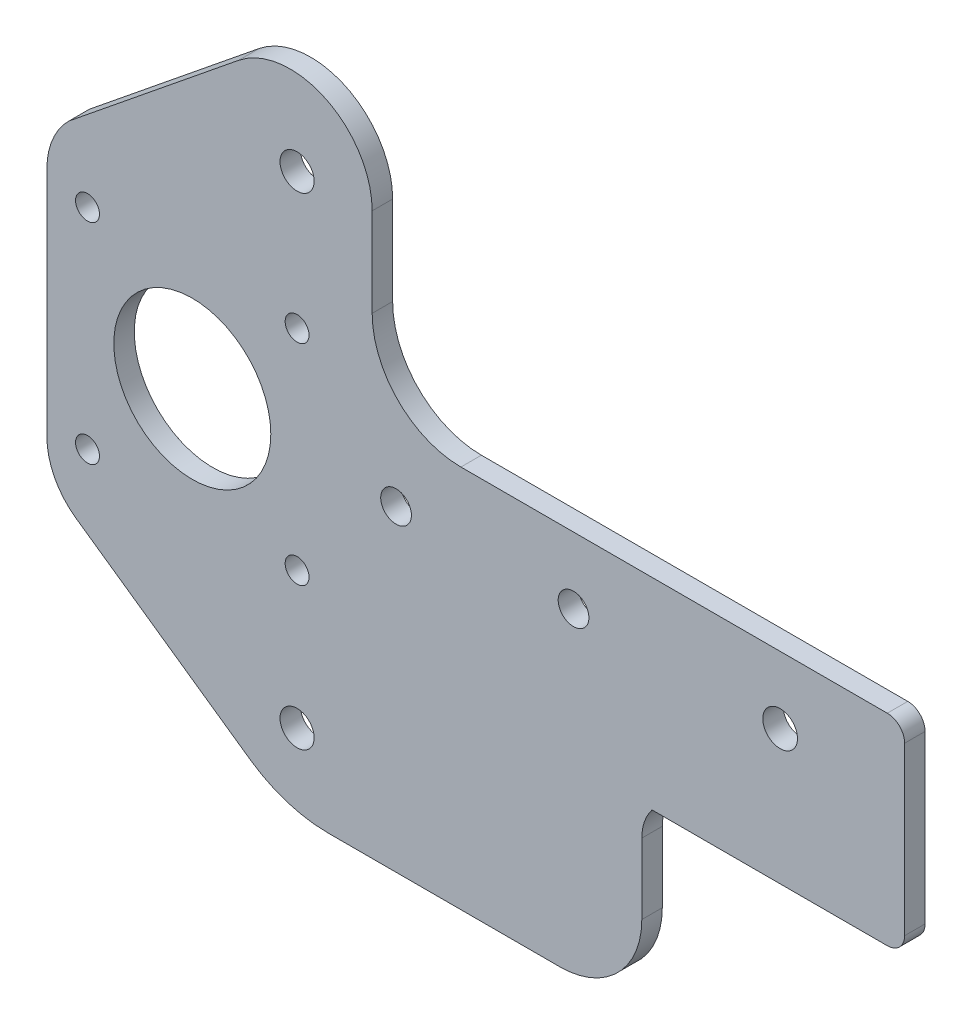
ISO-10303-21;
HEADER;
FILE_DESCRIPTION(('STEP AP214'),'2;1');
FILE_NAME('part.step','',(''),(''),'','','');
FILE_SCHEMA(('AUTOMOTIVE_DESIGN { 1 0 10303 214 1 1 1 1 }'));
ENDSEC;
DATA;
#1=APPLICATION_CONTEXT('core data for automotive mechanical design processes');
#2=APPLICATION_PROTOCOL_DEFINITION('international standard','automotive_design',2000,#1);
#3=PRODUCT_CONTEXT('',#1,'mechanical');
#4=PRODUCT('Part','Part','',(#3));
#5=PRODUCT_RELATED_PRODUCT_CATEGORY('part','',(#4));
#6=PRODUCT_DEFINITION_FORMATION('','',#4);
#7=PRODUCT_DEFINITION_CONTEXT('part definition',#1,'design');
#8=PRODUCT_DEFINITION('design','',#6,#7);
#9=PRODUCT_DEFINITION_SHAPE('','',#8);
#10=(LENGTH_UNIT() NAMED_UNIT(*) SI_UNIT(.MILLI.,.METRE.));
#11=(NAMED_UNIT(*) PLANE_ANGLE_UNIT() SI_UNIT($,.RADIAN.));
#12=(NAMED_UNIT(*) SI_UNIT($,.STERADIAN.) SOLID_ANGLE_UNIT());
#13=UNCERTAINTY_MEASURE_WITH_UNIT(LENGTH_MEASURE(1.E-05),#10,'distance_accuracy_value','');
#14=(GEOMETRIC_REPRESENTATION_CONTEXT(3) GLOBAL_UNCERTAINTY_ASSIGNED_CONTEXT((#13)) GLOBAL_UNIT_ASSIGNED_CONTEXT((#10,
#11,#12)) REPRESENTATION_CONTEXT('',''));
#15=CARTESIAN_POINT('',(0.,0.,0.));
#16=DIRECTION('',(0.,0.,1.));
#17=DIRECTION('',(1.,0.,0.));
#18=AXIS2_PLACEMENT_3D('',#15,#16,#17);
#19=CARTESIAN_POINT('',(-65.,13.,3.));
#20=DIRECTION('',(0.,0.,1.));
#21=DIRECTION('',(1.,0.,0.));
#22=AXIS2_PLACEMENT_3D('',#19,#20,#21);
#23=PLANE('',#22);
#24=CARTESIAN_POINT('',(-119.7,5.59999999999999,3.));
#25=DIRECTION('',(0.,0.,1.));
#26=DIRECTION('',(1.,0.,0.));
#27=AXIS2_PLACEMENT_3D('',#24,#25,#26);
#28=CIRCLE('',#27,1.75);
#29=CARTESIAN_POINT('',(-117.95,5.59999999999999,3.));
#30=VERTEX_POINT('',#29);
#31=EDGE_CURVE('E636',#30,#30,#28,.T.);
#32=ORIENTED_EDGE('',*,*,#31,.F.);
#33=EDGE_LOOP('',(#32));
#34=FACE_BOUND('',#33,.T.);
#35=CARTESIAN_POINT('',(-89.,-45.112,3.));
#36=DIRECTION('',(0.,0.,1.));
#37=DIRECTION('',(1.,0.,0.));
#38=AXIS2_PLACEMENT_3D('',#35,#36,#37);
#39=CIRCLE('',#38,2.5);
#40=CARTESIAN_POINT('',(-86.5,-45.112,3.));
#41=VERTEX_POINT('',#40);
#42=EDGE_CURVE('E648',#41,#41,#39,.T.);
#43=ORIENTED_EDGE('',*,*,#42,.F.);
#44=EDGE_LOOP('',(#43));
#45=FACE_BOUND('',#44,.T.);
#46=CARTESIAN_POINT('',(-89.,25.5,3.));
#47=DIRECTION('',(0.,0.,1.));
#48=DIRECTION('',(1.,0.,0.));
#49=AXIS2_PLACEMENT_3D('',#46,#47,#48);
#50=CIRCLE('',#49,2.5);
#51=CARTESIAN_POINT('',(-86.5,25.5,3.));
#52=VERTEX_POINT('',#51);
#53=EDGE_CURVE('E660',#52,#52,#50,.T.);
#54=ORIENTED_EDGE('',*,*,#53,.F.);
#55=EDGE_LOOP('',(#54));
#56=FACE_BOUND('',#55,.T.);
#57=CARTESIAN_POINT('',(-74.5,-9.75000000000001,3.));
#58=DIRECTION('',(0.,0.,1.));
#59=DIRECTION('',(1.,0.,0.));
#60=AXIS2_PLACEMENT_3D('',#57,#58,#59);
#61=CIRCLE('',#60,2.25);
#62=CARTESIAN_POINT('',(-72.25,-9.75000000000001,3.));
#63=VERTEX_POINT('',#62);
#64=EDGE_CURVE('E672',#63,#63,#61,.T.);
#65=ORIENTED_EDGE('',*,*,#64,.F.);
#66=EDGE_LOOP('',(#65));
#67=FACE_BOUND('',#66,.T.);
#68=CARTESIAN_POINT('',(-18.237,-9.80600000000001,3.));
#69=DIRECTION('',(0.,0.,1.));
#70=DIRECTION('',(1.,0.,0.));
#71=AXIS2_PLACEMENT_3D('',#68,#69,#70);
#72=CIRCLE('',#71,2.54);
#73=CARTESIAN_POINT('',(-15.697,-9.80600000000001,3.));
#74=VERTEX_POINT('',#73);
#75=EDGE_CURVE('E308',#74,#74,#72,.T.);
#76=ORIENTED_EDGE('',*,*,#75,.F.);
#77=EDGE_LOOP('',(#76));
#78=FACE_BOUND('',#77,.T.);
#79=DIRECTION('',(1.,0.,0.));
#80=VECTOR('',#79,1.);
#81=CARTESIAN_POINT('',(0.,-29.5,3.));
#82=LINE('',#81,#80);
#83=CARTESIAN_POINT('',(-37.,-29.5,3.));
#84=VERTEX_POINT('',#83);
#85=CARTESIAN_POINT('',(-2.54,-29.5,3.));
#86=VERTEX_POINT('',#85);
#87=EDGE_CURVE('E199',#84,#86,#82,.T.);
#88=ORIENTED_EDGE('',*,*,#87,.T.);
#89=CARTESIAN_POINT('',(-2.54,-26.96,3.));
#90=DIRECTION('',(0.,0.,1.));
#91=DIRECTION('',(1.,0.,0.));
#92=AXIS2_PLACEMENT_3D('',#89,#90,#91);
#93=CIRCLE('',#92,2.54);
#94=CARTESIAN_POINT('',(0.,-26.96,3.));
#95=VERTEX_POINT('',#94);
#96=EDGE_CURVE('E41',#86,#95,#93,.T.);
#97=ORIENTED_EDGE('',*,*,#96,.T.);
#98=DIRECTION('',(0.,1.,0.));
#99=VECTOR('',#98,1.);
#100=CARTESIAN_POINT('',(0.,0.,3.));
#101=LINE('',#100,#99);
#102=CARTESIAN_POINT('',(0.,-2.54,3.));
#103=VERTEX_POINT('',#102);
#104=EDGE_CURVE('E198',#95,#103,#101,.T.);
#105=ORIENTED_EDGE('',*,*,#104,.T.);
#106=CARTESIAN_POINT('',(-2.54,-2.54,3.));
#107=DIRECTION('',(0.,0.,1.));
#108=DIRECTION('',(1.,0.,0.));
#109=AXIS2_PLACEMENT_3D('',#106,#107,#108);
#110=CIRCLE('',#109,2.54);
#111=CARTESIAN_POINT('',(-2.54,0.,3.));
#112=VERTEX_POINT('',#111);
#113=EDGE_CURVE('E48',#103,#112,#110,.T.);
#114=ORIENTED_EDGE('',*,*,#113,.T.);
#115=DIRECTION('',(-1.,0.,0.));
#116=VECTOR('',#115,1.);
#117=CARTESIAN_POINT('',(0.,0.,3.));
#118=LINE('',#117,#116);
#119=CARTESIAN_POINT('',(-65.,0.,3.));
#120=VERTEX_POINT('',#119);
#121=EDGE_CURVE('E158',#112,#120,#118,.T.);
#122=ORIENTED_EDGE('',*,*,#121,.T.);
#123=CARTESIAN_POINT('',(-65.,13.,3.));
#124=DIRECTION('',(0.,0.,-1.));
#125=DIRECTION('',(1.,0.,0.));
#126=AXIS2_PLACEMENT_3D('',#123,#124,#125);
#127=CIRCLE('',#126,13.);
#128=CARTESIAN_POINT('',(-78.,13.,3.));
#129=VERTEX_POINT('',#128);
#130=EDGE_CURVE('E161',#120,#129,#127,.T.);
#131=ORIENTED_EDGE('',*,*,#130,.T.);
#132=DIRECTION('',(0.,1.,0.));
#133=VECTOR('',#132,1.);
#134=CARTESIAN_POINT('',(-78.,13.,3.));
#135=LINE('',#134,#133);
#136=CARTESIAN_POINT('',(-78.,26.,3.));
#137=VERTEX_POINT('',#136);
#138=EDGE_CURVE('E175',#129,#137,#135,.T.);
#139=ORIENTED_EDGE('',*,*,#138,.T.);
#140=CARTESIAN_POINT('',(-90.,26.,3.));
#141=DIRECTION('',(0.,0.,1.));
#142=DIRECTION('',(1.,0.,0.));
#143=AXIS2_PLACEMENT_3D('',#140,#141,#142);
#144=CIRCLE('',#143,12.);
#145=CARTESIAN_POINT('',(-97.5518446925981,35.3257515374836,3.));
#146=VERTEX_POINT('',#145);
#147=EDGE_CURVE('E264',#137,#146,#144,.T.);
#148=ORIENTED_EDGE('',*,*,#147,.T.);
#149=DIRECTION('',(-0.777145961456967,-0.629320391049842,0.));
#150=VECTOR('',#149,1.);
#151=CARTESIAN_POINT('',(-97.5518446925981,35.3257515374836,3.));
#152=LINE('',#151,#150);
#153=CARTESIAN_POINT('',(-122.420515459221,15.1874990238887,3.));
#154=VERTEX_POINT('',#153);
#155=EDGE_CURVE('E311',#146,#154,#152,.T.);
#156=ORIENTED_EDGE('',*,*,#155,.T.);
#157=CARTESIAN_POINT('',(-114.889537489488,7.50167283150509,3.));
#158=DIRECTION('',(0.,0.,1.));
#159=DIRECTION('',(1.,0.,0.));
#160=AXIS2_PLACEMENT_3D('',#157,#158,#159);
#161=CIRCLE('',#160,10.760462510512);
#162=CARTESIAN_POINT('',(-125.65,7.50167283150508,3.));
#163=VERTEX_POINT('',#162);
#164=EDGE_CURVE('E315',#154,#163,#161,.T.);
#165=ORIENTED_EDGE('',*,*,#164,.T.);
#166=DIRECTION('',(0.,-1.,0.));
#167=VECTOR('',#166,1.);
#168=CARTESIAN_POINT('',(-125.65,7.50167283150508,3.));
#169=LINE('',#168,#167);
#170=CARTESIAN_POINT('',(-125.65,-26.4983271684949,3.));
#171=VERTEX_POINT('',#170);
#172=EDGE_CURVE('E317',#163,#171,#169,.T.);
#173=ORIENTED_EDGE('',*,*,#172,.T.);
#174=CARTESIAN_POINT('',(-115.65,-26.4983271684949,3.));
#175=DIRECTION('',(0.,0.,1.));
#176=DIRECTION('',(1.,0.,0.));
#177=AXIS2_PLACEMENT_3D('',#174,#175,#176);
#178=CIRCLE('',#177,10.);
#179=CARTESIAN_POINT('',(-121.38576436351,-34.6898476113849,3.));
#180=VERTEX_POINT('',#179);
#181=EDGE_CURVE('E319',#171,#180,#178,.T.);
#182=ORIENTED_EDGE('',*,*,#181,.T.);
#183=DIRECTION('',(0.819152044288994,-0.573576436351044,0.));
#184=VECTOR('',#183,1.);
#185=CARTESIAN_POINT('',(-121.38576436351,-34.6898476113849,3.));
#186=LINE('',#185,#184);
#187=CARTESIAN_POINT('',(-95.8857643635104,-52.5451398357323,3.));
#188=VERTEX_POINT('',#187);
#189=EDGE_CURVE('E321',#180,#188,#186,.T.);
#190=ORIENTED_EDGE('',*,*,#189,.T.);
#191=CARTESIAN_POINT('',(-84.4142356364896,-36.1620989499525,3.));
#192=DIRECTION('',(0.,0.,1.));
#193=DIRECTION('',(1.,0.,0.));
#194=AXIS2_PLACEMENT_3D('',#191,#192,#193);
#195=CIRCLE('',#194,20.);
#196=CARTESIAN_POINT('',(-84.4142356364896,-56.1620989499525,3.));
#197=VERTEX_POINT('',#196);
#198=EDGE_CURVE('E323',#188,#197,#195,.T.);
#199=ORIENTED_EDGE('',*,*,#198,.T.);
#200=DIRECTION('',(1.,0.,0.));
#201=VECTOR('',#200,1.);
#202=CARTESIAN_POINT('',(-84.4142356364896,-56.1620989499525,3.));
#203=LINE('',#202,#201);
#204=CARTESIAN_POINT('',(-50.5,-56.1620989499525,3.));
#205=VERTEX_POINT('',#204);
#206=EDGE_CURVE('E325',#197,#205,#203,.T.);
#207=ORIENTED_EDGE('',*,*,#206,.T.);
#208=CARTESIAN_POINT('',(-50.5,-44.1620989499525,3.));
#209=DIRECTION('',(0.,0.,1.));
#210=DIRECTION('',(1.,0.,0.));
#211=AXIS2_PLACEMENT_3D('',#208,#209,#210);
#212=CIRCLE('',#211,12.);
#213=CARTESIAN_POINT('',(-38.5,-44.1620989499525,3.));
#214=VERTEX_POINT('',#213);
#215=EDGE_CURVE('E304',#205,#214,#212,.T.);
#216=ORIENTED_EDGE('',*,*,#215,.T.);
#217=DIRECTION('',(0.,1.,0.));
#218=VECTOR('',#217,1.);
#219=CARTESIAN_POINT('',(-38.5,-44.1620989499525,3.));
#220=LINE('',#219,#218);
#221=CARTESIAN_POINT('',(-38.5,-33.8301270189222,3.));
#222=VERTEX_POINT('',#221);
#223=EDGE_CURVE('E301',#214,#222,#220,.T.);
#224=ORIENTED_EDGE('',*,*,#223,.T.);
#225=CARTESIAN_POINT('',(-31.5,-33.8301270189222,3.));
#226=DIRECTION('',(0.,0.,-1.));
#227=DIRECTION('',(1.,0.,0.));
#228=AXIS2_PLACEMENT_3D('',#225,#226,#227);
#229=CIRCLE('',#228,7.);
#230=EDGE_CURVE('E300',#222,#84,#229,.T.);
#231=ORIENTED_EDGE('',*,*,#230,.T.);
#232=EDGE_LOOP('',(#88,#97,#105,#114,#122,#131,#139,#148,#156,#165,#173,#182,#190,#199,#207,
#216,#224,#231));
#233=FACE_BOUND('',#232,.T.);
#234=CARTESIAN_POINT('',(-48.5,-9.75000000000001,3.));
#235=DIRECTION('',(0.,0.,1.));
#236=DIRECTION('',(1.,0.,0.));
#237=AXIS2_PLACEMENT_3D('',#234,#235,#236);
#238=CIRCLE('',#237,2.25);
#239=CARTESIAN_POINT('',(-46.25,-9.75000000000001,3.));
#240=VERTEX_POINT('',#239);
#241=EDGE_CURVE('E678',#240,#240,#238,.T.);
#242=ORIENTED_EDGE('',*,*,#241,.F.);
#243=EDGE_LOOP('',(#242));
#244=FACE_BOUND('',#243,.T.);
#245=CARTESIAN_POINT('',(-89.,5.59999999999999,3.));
#246=DIRECTION('',(0.,0.,1.));
#247=DIRECTION('',(1.,0.,0.));
#248=AXIS2_PLACEMENT_3D('',#245,#246,#247);
#249=CIRCLE('',#248,1.75);
#250=CARTESIAN_POINT('',(-87.25,5.59999999999999,3.));
#251=VERTEX_POINT('',#250);
#252=EDGE_CURVE('E666',#251,#251,#249,.T.);
#253=ORIENTED_EDGE('',*,*,#252,.F.);
#254=EDGE_LOOP('',(#253));
#255=FACE_BOUND('',#254,.T.);
#256=CARTESIAN_POINT('',(-89.,-25.1,3.));
#257=DIRECTION('',(0.,0.,1.));
#258=DIRECTION('',(1.,0.,0.));
#259=AXIS2_PLACEMENT_3D('',#256,#257,#258);
#260=CIRCLE('',#259,1.75);
#261=CARTESIAN_POINT('',(-87.25,-25.1,3.));
#262=VERTEX_POINT('',#261);
#263=EDGE_CURVE('E654',#262,#262,#260,.T.);
#264=ORIENTED_EDGE('',*,*,#263,.F.);
#265=EDGE_LOOP('',(#264));
#266=FACE_BOUND('',#265,.T.);
#267=CARTESIAN_POINT('',(-104.35,-9.75000000000001,3.));
#268=DIRECTION('',(0.,0.,1.));
#269=DIRECTION('',(1.,0.,0.));
#270=AXIS2_PLACEMENT_3D('',#267,#268,#269);
#271=CIRCLE('',#270,11.5);
#272=CARTESIAN_POINT('',(-92.85,-9.75000000000001,3.));
#273=VERTEX_POINT('',#272);
#274=EDGE_CURVE('E642',#273,#273,#271,.T.);
#275=ORIENTED_EDGE('',*,*,#274,.F.);
#276=EDGE_LOOP('',(#275));
#277=FACE_BOUND('',#276,.T.);
#278=CARTESIAN_POINT('',(-119.7,-25.1,3.));
#279=DIRECTION('',(0.,0.,1.));
#280=DIRECTION('',(1.,0.,0.));
#281=AXIS2_PLACEMENT_3D('',#278,#279,#280);
#282=CIRCLE('',#281,1.75);
#283=CARTESIAN_POINT('',(-117.95,-25.1,3.));
#284=VERTEX_POINT('',#283);
#285=EDGE_CURVE('E627',#284,#284,#282,.T.);
#286=ORIENTED_EDGE('',*,*,#285,.F.);
#287=EDGE_LOOP('',(#286));
#288=FACE_BOUND('',#287,.T.);
#289=ADVANCED_FACE('F33',(#34,#45,#56,#67,#78,#233,#244,#255,#266,#277,#288),#23,.T.);
#290=CARTESIAN_POINT('',(-65.,13.,0.));
#291=DIRECTION('',(0.,0.,1.));
#292=DIRECTION('',(1.,0.,0.));
#293=AXIS2_PLACEMENT_3D('',#290,#291,#292);
#294=PLANE('',#293);
#295=DIRECTION('',(0.,1.,0.));
#296=VECTOR('',#295,1.);
#297=CARTESIAN_POINT('',(0.,0.,0.));
#298=LINE('',#297,#296);
#299=CARTESIAN_POINT('',(0.,-26.96,0.));
#300=VERTEX_POINT('',#299);
#301=CARTESIAN_POINT('',(0.,-2.54,0.));
#302=VERTEX_POINT('',#301);
#303=EDGE_CURVE('E166',#300,#302,#298,.T.);
#304=ORIENTED_EDGE('',*,*,#303,.F.);
#305=CARTESIAN_POINT('',(-2.54,-26.96,0.));
#306=DIRECTION('',(0.,0.,1.));
#307=DIRECTION('',(1.,0.,0.));
#308=AXIS2_PLACEMENT_3D('',#305,#306,#307);
#309=CIRCLE('',#308,2.54);
#310=CARTESIAN_POINT('',(-2.54,-29.5,0.));
#311=VERTEX_POINT('',#310);
#312=EDGE_CURVE('E193',#300,#311,#309,.F.);
#313=ORIENTED_EDGE('',*,*,#312,.T.);
#314=DIRECTION('',(1.,0.,0.));
#315=VECTOR('',#314,1.);
#316=CARTESIAN_POINT('',(0.,-29.5,0.));
#317=LINE('',#316,#315);
#318=CARTESIAN_POINT('',(-37.,-29.5,0.));
#319=VERTEX_POINT('',#318);
#320=EDGE_CURVE('E215',#319,#311,#317,.T.);
#321=ORIENTED_EDGE('',*,*,#320,.F.);
#322=CARTESIAN_POINT('',(-31.5,-33.8301270189222,0.));
#323=DIRECTION('',(0.,0.,-1.));
#324=DIRECTION('',(1.,0.,0.));
#325=AXIS2_PLACEMENT_3D('',#322,#323,#324);
#326=CIRCLE('',#325,7.);
#327=CARTESIAN_POINT('',(-38.5,-33.8301270189222,0.));
#328=VERTEX_POINT('',#327);
#329=EDGE_CURVE('E219',#328,#319,#326,.T.);
#330=ORIENTED_EDGE('',*,*,#329,.F.);
#331=DIRECTION('',(0.,1.,0.));
#332=VECTOR('',#331,1.);
#333=CARTESIAN_POINT('',(-38.5,-44.1620989499525,0.));
#334=LINE('',#333,#332);
#335=CARTESIAN_POINT('',(-38.5,-44.1620989499525,0.));
#336=VERTEX_POINT('',#335);
#337=EDGE_CURVE('E222',#336,#328,#334,.T.);
#338=ORIENTED_EDGE('',*,*,#337,.F.);
#339=CARTESIAN_POINT('',(-50.5,-44.1620989499525,0.));
#340=DIRECTION('',(0.,0.,1.));
#341=DIRECTION('',(1.,0.,0.));
#342=AXIS2_PLACEMENT_3D('',#339,#340,#341);
#343=CIRCLE('',#342,12.);
#344=CARTESIAN_POINT('',(-50.5,-56.1620989499525,0.));
#345=VERTEX_POINT('',#344);
#346=EDGE_CURVE('E289',#345,#336,#343,.T.);
#347=ORIENTED_EDGE('',*,*,#346,.F.);
#348=DIRECTION('',(1.,0.,0.));
#349=VECTOR('',#348,1.);
#350=CARTESIAN_POINT('',(-84.4142356364896,-56.1620989499525,0.));
#351=LINE('',#350,#349);
#352=CARTESIAN_POINT('',(-84.4142356364896,-56.1620989499525,0.));
#353=VERTEX_POINT('',#352);
#354=EDGE_CURVE('E287',#353,#345,#351,.T.);
#355=ORIENTED_EDGE('',*,*,#354,.F.);
#356=CARTESIAN_POINT('',(-84.4142356364896,-36.1620989499525,0.));
#357=DIRECTION('',(0.,0.,1.));
#358=DIRECTION('',(1.,0.,0.));
#359=AXIS2_PLACEMENT_3D('',#356,#357,#358);
#360=CIRCLE('',#359,20.);
#361=CARTESIAN_POINT('',(-95.8857643635104,-52.5451398357323,0.));
#362=VERTEX_POINT('',#361);
#363=EDGE_CURVE('E285',#362,#353,#360,.T.);
#364=ORIENTED_EDGE('',*,*,#363,.F.);
#365=DIRECTION('',(0.819152044288994,-0.573576436351044,0.));
#366=VECTOR('',#365,1.);
#367=CARTESIAN_POINT('',(-121.38576436351,-34.6898476113849,0.));
#368=LINE('',#367,#366);
#369=CARTESIAN_POINT('',(-121.38576436351,-34.6898476113849,0.));
#370=VERTEX_POINT('',#369);
#371=EDGE_CURVE('E283',#370,#362,#368,.T.);
#372=ORIENTED_EDGE('',*,*,#371,.F.);
#373=CARTESIAN_POINT('',(-115.65,-26.4983271684949,0.));
#374=DIRECTION('',(0.,0.,1.));
#375=DIRECTION('',(1.,0.,0.));
#376=AXIS2_PLACEMENT_3D('',#373,#374,#375);
#377=CIRCLE('',#376,10.);
#378=CARTESIAN_POINT('',(-125.65,-26.4983271684949,0.));
#379=VERTEX_POINT('',#378);
#380=EDGE_CURVE('E281',#379,#370,#377,.T.);
#381=ORIENTED_EDGE('',*,*,#380,.F.);
#382=DIRECTION('',(0.,-1.,0.));
#383=VECTOR('',#382,1.);
#384=CARTESIAN_POINT('',(-125.65,7.50167283150508,0.));
#385=LINE('',#384,#383);
#386=CARTESIAN_POINT('',(-125.65,7.50167283150508,0.));
#387=VERTEX_POINT('',#386);
#388=EDGE_CURVE('E279',#387,#379,#385,.T.);
#389=ORIENTED_EDGE('',*,*,#388,.F.);
#390=CARTESIAN_POINT('',(-114.889537489488,7.50167283150509,0.));
#391=DIRECTION('',(0.,0.,1.));
#392=DIRECTION('',(1.,0.,0.));
#393=AXIS2_PLACEMENT_3D('',#390,#391,#392);
#394=CIRCLE('',#393,10.760462510512);
#395=CARTESIAN_POINT('',(-122.420515459221,15.1874990238887,0.));
#396=VERTEX_POINT('',#395);
#397=EDGE_CURVE('E272',#396,#387,#394,.T.);
#398=ORIENTED_EDGE('',*,*,#397,.F.);
#399=DIRECTION('',(-0.777145961456967,-0.629320391049842,0.));
#400=VECTOR('',#399,1.);
#401=CARTESIAN_POINT('',(-97.5518446925981,35.3257515374836,0.));
#402=LINE('',#401,#400);
#403=CARTESIAN_POINT('',(-97.5518446925981,35.3257515374836,0.));
#404=VERTEX_POINT('',#403);
#405=EDGE_CURVE('E270',#404,#396,#402,.T.);
#406=ORIENTED_EDGE('',*,*,#405,.F.);
#407=CARTESIAN_POINT('',(-90.,26.,0.));
#408=DIRECTION('',(0.,0.,1.));
#409=DIRECTION('',(1.,0.,0.));
#410=AXIS2_PLACEMENT_3D('',#407,#408,#409);
#411=CIRCLE('',#410,12.);
#412=CARTESIAN_POINT('',(-78.,26.,0.));
#413=VERTEX_POINT('',#412);
#414=EDGE_CURVE('E263',#413,#404,#411,.T.);
#415=ORIENTED_EDGE('',*,*,#414,.F.);
#416=DIRECTION('',(0.,1.,0.));
#417=VECTOR('',#416,1.);
#418=CARTESIAN_POINT('',(-78.,13.,0.));
#419=LINE('',#418,#417);
#420=CARTESIAN_POINT('',(-78.,13.,0.));
#421=VERTEX_POINT('',#420);
#422=EDGE_CURVE('E268',#421,#413,#419,.T.);
#423=ORIENTED_EDGE('',*,*,#422,.F.);
#424=CARTESIAN_POINT('',(-65.,13.,0.));
#425=DIRECTION('',(0.,0.,-1.));
#426=DIRECTION('',(1.,0.,0.));
#427=AXIS2_PLACEMENT_3D('',#424,#425,#426);
#428=CIRCLE('',#427,13.);
#429=CARTESIAN_POINT('',(-65.,0.,0.));
#430=VERTEX_POINT('',#429);
#431=EDGE_CURVE('E274',#430,#421,#428,.T.);
#432=ORIENTED_EDGE('',*,*,#431,.F.);
#433=DIRECTION('',(-1.,0.,0.));
#434=VECTOR('',#433,1.);
#435=CARTESIAN_POINT('',(0.,0.,0.));
#436=LINE('',#435,#434);
#437=CARTESIAN_POINT('',(-2.54,0.,0.));
#438=VERTEX_POINT('',#437);
#439=EDGE_CURVE('E179',#438,#430,#436,.T.);
#440=ORIENTED_EDGE('',*,*,#439,.F.);
#441=CARTESIAN_POINT('',(-2.54,-2.54,0.));
#442=DIRECTION('',(0.,0.,1.));
#443=DIRECTION('',(1.,0.,0.));
#444=AXIS2_PLACEMENT_3D('',#441,#442,#443);
#445=CIRCLE('',#444,2.54);
#446=EDGE_CURVE('E191',#438,#302,#445,.F.);
#447=ORIENTED_EDGE('',*,*,#446,.T.);
#448=EDGE_LOOP('',(#304,#313,#321,#330,#338,#347,#355,#364,#372,#381,#389,#398,#406,#415,#423,
#432,#440,#447));
#449=FACE_BOUND('',#448,.T.);
#450=CARTESIAN_POINT('',(-18.237,-9.80600000000001,0.));
#451=DIRECTION('',(0.,0.,1.));
#452=DIRECTION('',(1.,0.,0.));
#453=AXIS2_PLACEMENT_3D('',#450,#451,#452);
#454=CIRCLE('',#453,2.54);
#455=CARTESIAN_POINT('',(-15.697,-9.80600000000001,0.));
#456=VERTEX_POINT('',#455);
#457=EDGE_CURVE('E681',#456,#456,#454,.T.);
#458=ORIENTED_EDGE('',*,*,#457,.T.);
#459=EDGE_LOOP('',(#458));
#460=FACE_BOUND('',#459,.T.);
#461=CARTESIAN_POINT('',(-48.5,-9.75000000000001,0.));
#462=DIRECTION('',(0.,0.,1.));
#463=DIRECTION('',(1.,0.,0.));
#464=AXIS2_PLACEMENT_3D('',#461,#462,#463);
#465=CIRCLE('',#464,2.25);
#466=CARTESIAN_POINT('',(-46.25,-9.75000000000001,0.));
#467=VERTEX_POINT('',#466);
#468=EDGE_CURVE('E675',#467,#467,#465,.T.);
#469=ORIENTED_EDGE('',*,*,#468,.T.);
#470=EDGE_LOOP('',(#469));
#471=FACE_BOUND('',#470,.T.);
#472=CARTESIAN_POINT('',(-74.5,-9.75000000000001,0.));
#473=DIRECTION('',(0.,0.,1.));
#474=DIRECTION('',(1.,0.,0.));
#475=AXIS2_PLACEMENT_3D('',#472,#473,#474);
#476=CIRCLE('',#475,2.25);
#477=CARTESIAN_POINT('',(-72.25,-9.75000000000001,0.));
#478=VERTEX_POINT('',#477);
#479=EDGE_CURVE('E669',#478,#478,#476,.T.);
#480=ORIENTED_EDGE('',*,*,#479,.T.);
#481=EDGE_LOOP('',(#480));
#482=FACE_BOUND('',#481,.T.);
#483=CARTESIAN_POINT('',(-89.,5.59999999999999,0.));
#484=DIRECTION('',(0.,0.,1.));
#485=DIRECTION('',(1.,0.,0.));
#486=AXIS2_PLACEMENT_3D('',#483,#484,#485);
#487=CIRCLE('',#486,1.75);
#488=CARTESIAN_POINT('',(-87.25,5.59999999999999,0.));
#489=VERTEX_POINT('',#488);
#490=EDGE_CURVE('E663',#489,#489,#487,.T.);
#491=ORIENTED_EDGE('',*,*,#490,.T.);
#492=EDGE_LOOP('',(#491));
#493=FACE_BOUND('',#492,.T.);
#494=CARTESIAN_POINT('',(-89.,25.5,0.));
#495=DIRECTION('',(0.,0.,1.));
#496=DIRECTION('',(1.,0.,0.));
#497=AXIS2_PLACEMENT_3D('',#494,#495,#496);
#498=CIRCLE('',#497,2.5);
#499=CARTESIAN_POINT('',(-86.5,25.5,0.));
#500=VERTEX_POINT('',#499);
#501=EDGE_CURVE('E657',#500,#500,#498,.T.);
#502=ORIENTED_EDGE('',*,*,#501,.T.);
#503=EDGE_LOOP('',(#502));
#504=FACE_BOUND('',#503,.T.);
#505=CARTESIAN_POINT('',(-89.,-25.1,0.));
#506=DIRECTION('',(0.,0.,1.));
#507=DIRECTION('',(1.,0.,0.));
#508=AXIS2_PLACEMENT_3D('',#505,#506,#507);
#509=CIRCLE('',#508,1.75);
#510=CARTESIAN_POINT('',(-87.25,-25.1,0.));
#511=VERTEX_POINT('',#510);
#512=EDGE_CURVE('E651',#511,#511,#509,.T.);
#513=ORIENTED_EDGE('',*,*,#512,.T.);
#514=EDGE_LOOP('',(#513));
#515=FACE_BOUND('',#514,.T.);
#516=CARTESIAN_POINT('',(-89.,-45.112,0.));
#517=DIRECTION('',(0.,0.,1.));
#518=DIRECTION('',(1.,0.,0.));
#519=AXIS2_PLACEMENT_3D('',#516,#517,#518);
#520=CIRCLE('',#519,2.5);
#521=CARTESIAN_POINT('',(-86.5,-45.112,0.));
#522=VERTEX_POINT('',#521);
#523=EDGE_CURVE('E645',#522,#522,#520,.T.);
#524=ORIENTED_EDGE('',*,*,#523,.T.);
#525=EDGE_LOOP('',(#524));
#526=FACE_BOUND('',#525,.T.);
#527=CARTESIAN_POINT('',(-104.35,-9.75000000000001,0.));
#528=DIRECTION('',(0.,0.,1.));
#529=DIRECTION('',(1.,0.,0.));
#530=AXIS2_PLACEMENT_3D('',#527,#528,#529);
#531=CIRCLE('',#530,11.5);
#532=CARTESIAN_POINT('',(-92.85,-9.75000000000001,0.));
#533=VERTEX_POINT('',#532);
#534=EDGE_CURVE('E639',#533,#533,#531,.T.);
#535=ORIENTED_EDGE('',*,*,#534,.T.);
#536=EDGE_LOOP('',(#535));
#537=FACE_BOUND('',#536,.T.);
#538=CARTESIAN_POINT('',(-119.7,5.59999999999999,0.));
#539=DIRECTION('',(0.,0.,1.));
#540=DIRECTION('',(1.,0.,0.));
#541=AXIS2_PLACEMENT_3D('',#538,#539,#540);
#542=CIRCLE('',#541,1.75);
#543=CARTESIAN_POINT('',(-117.95,5.59999999999999,0.));
#544=VERTEX_POINT('',#543);
#545=EDGE_CURVE('E633',#544,#544,#542,.T.);
#546=ORIENTED_EDGE('',*,*,#545,.T.);
#547=EDGE_LOOP('',(#546));
#548=FACE_BOUND('',#547,.T.);
#549=CARTESIAN_POINT('',(-119.7,-25.1,0.));
#550=DIRECTION('',(0.,0.,1.));
#551=DIRECTION('',(1.,0.,0.));
#552=AXIS2_PLACEMENT_3D('',#549,#550,#551);
#553=CIRCLE('',#552,1.75);
#554=CARTESIAN_POINT('',(-117.95,-25.1,0.));
#555=VERTEX_POINT('',#554);
#556=EDGE_CURVE('E630',#555,#555,#553,.T.);
#557=ORIENTED_EDGE('',*,*,#556,.T.);
#558=EDGE_LOOP('',(#557));
#559=FACE_BOUND('',#558,.T.);
#560=ADVANCED_FACE('F212',(#449,#460,#471,#482,#493,#504,#515,#526,#537,#548,#559),#294,.F.);
#561=CARTESIAN_POINT('',(0.,0.,3.));
#562=DIRECTION('',(0.,-1.,0.));
#563=DIRECTION('',(1.,0.,0.));
#564=AXIS2_PLACEMENT_3D('',#561,#562,#563);
#565=PLANE('',#564);
#566=ORIENTED_EDGE('',*,*,#121,.F.);
#567=DIRECTION('',(0.,0.,-1.));
#568=VECTOR('',#567,1.);
#569=CARTESIAN_POINT('',(-2.54,0.,3.));
#570=LINE('',#569,#568);
#571=EDGE_CURVE('E11',#112,#438,#570,.T.);
#572=ORIENTED_EDGE('',*,*,#571,.T.);
#573=ORIENTED_EDGE('',*,*,#439,.T.);
#574=DIRECTION('',(0.,0.,-1.));
#575=VECTOR('',#574,1.);
#576=CARTESIAN_POINT('',(-65.,0.,3.));
#577=LINE('',#576,#575);
#578=EDGE_CURVE('E171',#120,#430,#577,.T.);
#579=ORIENTED_EDGE('',*,*,#578,.F.);
#580=EDGE_LOOP('',(#566,#572,#573,#579));
#581=FACE_BOUND('',#580,.T.);
#582=ADVANCED_FACE('F177',(#581),#565,.F.);
#583=CARTESIAN_POINT('',(-65.,13.,3.));
#584=DIRECTION('',(0.,0.,-1.));
#585=DIRECTION('',(-1.,0.,0.));
#586=AXIS2_PLACEMENT_3D('',#583,#584,#585);
#587=CYLINDRICAL_SURFACE('',#586,13.);
#588=ORIENTED_EDGE('',*,*,#431,.T.);
#589=DIRECTION('',(0.,0.,-1.));
#590=VECTOR('',#589,1.);
#591=CARTESIAN_POINT('',(-78.,13.,3.));
#592=LINE('',#591,#590);
#593=EDGE_CURVE('E173',#129,#421,#592,.T.);
#594=ORIENTED_EDGE('',*,*,#593,.F.);
#595=ORIENTED_EDGE('',*,*,#130,.F.);
#596=ORIENTED_EDGE('',*,*,#578,.T.);
#597=EDGE_LOOP('',(#588,#594,#595,#596));
#598=FACE_BOUND('',#597,.T.);
#599=ADVANCED_FACE('F170',(#598),#587,.F.);
#600=CARTESIAN_POINT('',(-78.,13.,3.));
#601=DIRECTION('',(-1.,0.,0.));
#602=DIRECTION('',(0.,-1.,0.));
#603=AXIS2_PLACEMENT_3D('',#600,#601,#602);
#604=PLANE('',#603);
#605=ORIENTED_EDGE('',*,*,#422,.T.);
#606=DIRECTION('',(0.,0.,-1.));
#607=VECTOR('',#606,1.);
#608=CARTESIAN_POINT('',(-78.,26.,3.));
#609=LINE('',#608,#607);
#610=EDGE_CURVE('E185',#137,#413,#609,.T.);
#611=ORIENTED_EDGE('',*,*,#610,.F.);
#612=ORIENTED_EDGE('',*,*,#138,.F.);
#613=ORIENTED_EDGE('',*,*,#593,.T.);
#614=EDGE_LOOP('',(#605,#611,#612,#613));
#615=FACE_BOUND('',#614,.T.);
#616=ADVANCED_FACE('F309',(#615),#604,.F.);
#617=CARTESIAN_POINT('',(-90.,26.,3.));
#618=DIRECTION('',(0.,0.,-1.));
#619=DIRECTION('',(-1.,0.,0.));
#620=AXIS2_PLACEMENT_3D('',#617,#618,#619);
#621=CYLINDRICAL_SURFACE('',#620,12.);
#622=ORIENTED_EDGE('',*,*,#414,.T.);
#623=DIRECTION('',(0.,0.,-1.));
#624=VECTOR('',#623,1.);
#625=CARTESIAN_POINT('',(-97.5518446925981,35.3257515374836,3.));
#626=LINE('',#625,#624);
#627=EDGE_CURVE('E254',#146,#404,#626,.T.);
#628=ORIENTED_EDGE('',*,*,#627,.F.);
#629=ORIENTED_EDGE('',*,*,#147,.F.);
#630=ORIENTED_EDGE('',*,*,#610,.T.);
#631=EDGE_LOOP('',(#622,#628,#629,#630));
#632=FACE_BOUND('',#631,.T.);
#633=ADVANCED_FACE('F261',(#632),#621,.T.);
#634=CARTESIAN_POINT('',(-97.5518446925981,35.3257515374836,3.));
#635=DIRECTION('',(0.629320391049842,-0.777145961456967,0.));
#636=DIRECTION('',(0.777145961456967,0.629320391049842,0.));
#637=AXIS2_PLACEMENT_3D('',#634,#635,#636);
#638=PLANE('',#637);
#639=ORIENTED_EDGE('',*,*,#405,.T.);
#640=DIRECTION('',(0.,0.,-1.));
#641=VECTOR('',#640,1.);
#642=CARTESIAN_POINT('',(-122.420515459221,15.1874990238887,3.));
#643=LINE('',#642,#641);
#644=EDGE_CURVE('E251',#154,#396,#643,.T.);
#645=ORIENTED_EDGE('',*,*,#644,.F.);
#646=ORIENTED_EDGE('',*,*,#155,.F.);
#647=ORIENTED_EDGE('',*,*,#627,.T.);
#648=EDGE_LOOP('',(#639,#645,#646,#647));
#649=FACE_BOUND('',#648,.T.);
#650=ADVANCED_FACE('F361',(#649),#638,.F.);
#651=CARTESIAN_POINT('',(-114.889537489488,7.50167283150509,3.));
#652=DIRECTION('',(0.,0.,-1.));
#653=DIRECTION('',(-1.,0.,0.));
#654=AXIS2_PLACEMENT_3D('',#651,#652,#653);
#655=CYLINDRICAL_SURFACE('',#654,10.760462510512);
#656=ORIENTED_EDGE('',*,*,#397,.T.);
#657=DIRECTION('',(0.,0.,-1.));
#658=VECTOR('',#657,1.);
#659=CARTESIAN_POINT('',(-125.65,7.50167283150508,3.));
#660=LINE('',#659,#658);
#661=EDGE_CURVE('E248',#163,#387,#660,.T.);
#662=ORIENTED_EDGE('',*,*,#661,.F.);
#663=ORIENTED_EDGE('',*,*,#164,.F.);
#664=ORIENTED_EDGE('',*,*,#644,.T.);
#665=EDGE_LOOP('',(#656,#662,#663,#664));
#666=FACE_BOUND('',#665,.T.);
#667=ADVANCED_FACE('F357',(#666),#655,.T.);
#668=CARTESIAN_POINT('',(-125.65,7.50167283150508,3.));
#669=DIRECTION('',(1.,0.,0.));
#670=DIRECTION('',(0.,0.,-1.));
#671=AXIS2_PLACEMENT_3D('',#668,#669,#670);
#672=PLANE('',#671);
#673=ORIENTED_EDGE('',*,*,#388,.T.);
#674=DIRECTION('',(0.,0.,-1.));
#675=VECTOR('',#674,1.);
#676=CARTESIAN_POINT('',(-125.65,-26.4983271684949,3.));
#677=LINE('',#676,#675);
#678=EDGE_CURVE('E245',#171,#379,#677,.T.);
#679=ORIENTED_EDGE('',*,*,#678,.F.);
#680=ORIENTED_EDGE('',*,*,#172,.F.);
#681=ORIENTED_EDGE('',*,*,#661,.T.);
#682=EDGE_LOOP('',(#673,#679,#680,#681));
#683=FACE_BOUND('',#682,.T.);
#684=ADVANCED_FACE('F353',(#683),#672,.F.);
#685=CARTESIAN_POINT('',(-115.65,-26.4983271684949,3.));
#686=DIRECTION('',(0.,0.,-1.));
#687=DIRECTION('',(-1.,0.,0.));
#688=AXIS2_PLACEMENT_3D('',#685,#686,#687);
#689=CYLINDRICAL_SURFACE('',#688,10.);
#690=ORIENTED_EDGE('',*,*,#380,.T.);
#691=DIRECTION('',(0.,0.,-1.));
#692=VECTOR('',#691,1.);
#693=CARTESIAN_POINT('',(-121.38576436351,-34.6898476113849,3.));
#694=LINE('',#693,#692);
#695=EDGE_CURVE('E242',#180,#370,#694,.T.);
#696=ORIENTED_EDGE('',*,*,#695,.F.);
#697=ORIENTED_EDGE('',*,*,#181,.F.);
#698=ORIENTED_EDGE('',*,*,#678,.T.);
#699=EDGE_LOOP('',(#690,#696,#697,#698));
#700=FACE_BOUND('',#699,.T.);
#701=ADVANCED_FACE('F348',(#700),#689,.T.);
#702=CARTESIAN_POINT('',(-121.38576436351,-34.6898476113849,3.));
#703=DIRECTION('',(0.573576436351044,0.819152044288993,0.));
#704=DIRECTION('',(-0.819152044288994,0.573576436351044,0.));
#705=AXIS2_PLACEMENT_3D('',#702,#703,#704);
#706=PLANE('',#705);
#707=ORIENTED_EDGE('',*,*,#371,.T.);
#708=DIRECTION('',(0.,0.,-1.));
#709=VECTOR('',#708,1.);
#710=CARTESIAN_POINT('',(-95.8857643635104,-52.5451398357323,3.));
#711=LINE('',#710,#709);
#712=EDGE_CURVE('E239',#188,#362,#711,.T.);
#713=ORIENTED_EDGE('',*,*,#712,.F.);
#714=ORIENTED_EDGE('',*,*,#189,.F.);
#715=ORIENTED_EDGE('',*,*,#695,.T.);
#716=EDGE_LOOP('',(#707,#713,#714,#715));
#717=FACE_BOUND('',#716,.T.);
#718=ADVANCED_FACE('F343',(#717),#706,.F.);
#719=CARTESIAN_POINT('',(-84.4142356364896,-36.1620989499525,3.));
#720=DIRECTION('',(0.,0.,-1.));
#721=DIRECTION('',(-1.,0.,0.));
#722=AXIS2_PLACEMENT_3D('',#719,#720,#721);
#723=CYLINDRICAL_SURFACE('',#722,20.);
#724=ORIENTED_EDGE('',*,*,#363,.T.);
#725=DIRECTION('',(0.,0.,-1.));
#726=VECTOR('',#725,1.);
#727=CARTESIAN_POINT('',(-84.4142356364896,-56.1620989499525,3.));
#728=LINE('',#727,#726);
#729=EDGE_CURVE('E236',#197,#353,#728,.T.);
#730=ORIENTED_EDGE('',*,*,#729,.F.);
#731=ORIENTED_EDGE('',*,*,#198,.F.);
#732=ORIENTED_EDGE('',*,*,#712,.T.);
#733=EDGE_LOOP('',(#724,#730,#731,#732));
#734=FACE_BOUND('',#733,.T.);
#735=ADVANCED_FACE('F339',(#734),#723,.T.);
#736=CARTESIAN_POINT('',(-84.4142356364896,-56.1620989499525,3.));
#737=DIRECTION('',(0.,1.,0.));
#738=DIRECTION('',(-1.,0.,0.));
#739=AXIS2_PLACEMENT_3D('',#736,#737,#738);
#740=PLANE('',#739);
#741=ORIENTED_EDGE('',*,*,#354,.T.);
#742=DIRECTION('',(0.,0.,-1.));
#743=VECTOR('',#742,1.);
#744=CARTESIAN_POINT('',(-50.5,-56.1620989499525,3.));
#745=LINE('',#744,#743);
#746=EDGE_CURVE('E233',#205,#345,#745,.T.);
#747=ORIENTED_EDGE('',*,*,#746,.F.);
#748=ORIENTED_EDGE('',*,*,#206,.F.);
#749=ORIENTED_EDGE('',*,*,#729,.T.);
#750=EDGE_LOOP('',(#741,#747,#748,#749));
#751=FACE_BOUND('',#750,.T.);
#752=ADVANCED_FACE('F335',(#751),#740,.F.);
#753=CARTESIAN_POINT('',(-50.5,-44.1620989499525,3.));
#754=DIRECTION('',(0.,0.,-1.));
#755=DIRECTION('',(-1.,0.,0.));
#756=AXIS2_PLACEMENT_3D('',#753,#754,#755);
#757=CYLINDRICAL_SURFACE('',#756,12.);
#758=ORIENTED_EDGE('',*,*,#346,.T.);
#759=DIRECTION('',(0.,0.,-1.));
#760=VECTOR('',#759,1.);
#761=CARTESIAN_POINT('',(-38.5,-44.1620989499525,3.));
#762=LINE('',#761,#760);
#763=EDGE_CURVE('E230',#214,#336,#762,.T.);
#764=ORIENTED_EDGE('',*,*,#763,.F.);
#765=ORIENTED_EDGE('',*,*,#215,.F.);
#766=ORIENTED_EDGE('',*,*,#746,.T.);
#767=EDGE_LOOP('',(#758,#764,#765,#766));
#768=FACE_BOUND('',#767,.T.);
#769=ADVANCED_FACE('F330',(#768),#757,.T.);
#770=CARTESIAN_POINT('',(-38.5,-44.1620989499525,3.));
#771=DIRECTION('',(-1.,0.,0.));
#772=DIRECTION('',(0.,-1.,0.));
#773=AXIS2_PLACEMENT_3D('',#770,#771,#772);
#774=PLANE('',#773);
#775=ORIENTED_EDGE('',*,*,#337,.T.);
#776=DIRECTION('',(0.,0.,-1.));
#777=VECTOR('',#776,1.);
#778=CARTESIAN_POINT('',(-38.5,-33.8301270189222,3.));
#779=LINE('',#778,#777);
#780=EDGE_CURVE('E227',#222,#328,#779,.T.);
#781=ORIENTED_EDGE('',*,*,#780,.F.);
#782=ORIENTED_EDGE('',*,*,#223,.F.);
#783=ORIENTED_EDGE('',*,*,#763,.T.);
#784=EDGE_LOOP('',(#775,#781,#782,#783));
#785=FACE_BOUND('',#784,.T.);
#786=ADVANCED_FACE('F293',(#785),#774,.F.);
#787=CARTESIAN_POINT('',(-31.5,-33.8301270189222,3.));
#788=DIRECTION('',(0.,0.,-1.));
#789=DIRECTION('',(-1.,0.,0.));
#790=AXIS2_PLACEMENT_3D('',#787,#788,#789);
#791=CYLINDRICAL_SURFACE('',#790,7.);
#792=ORIENTED_EDGE('',*,*,#329,.T.);
#793=DIRECTION('',(0.,0.,-1.));
#794=VECTOR('',#793,1.);
#795=CARTESIAN_POINT('',(-37.,-29.5,3.));
#796=LINE('',#795,#794);
#797=EDGE_CURVE('E207',#84,#319,#796,.T.);
#798=ORIENTED_EDGE('',*,*,#797,.F.);
#799=ORIENTED_EDGE('',*,*,#230,.F.);
#800=ORIENTED_EDGE('',*,*,#780,.T.);
#801=EDGE_LOOP('',(#792,#798,#799,#800));
#802=FACE_BOUND('',#801,.T.);
#803=ADVANCED_FACE('F299',(#802),#791,.F.);
#804=CARTESIAN_POINT('',(0.,-29.5,3.));
#805=DIRECTION('',(0.,1.,0.));
#806=DIRECTION('',(-1.,0.,0.));
#807=AXIS2_PLACEMENT_3D('',#804,#805,#806);
#808=PLANE('',#807);
#809=ORIENTED_EDGE('',*,*,#320,.T.);
#810=DIRECTION('',(0.,0.,-1.));
#811=VECTOR('',#810,1.);
#812=CARTESIAN_POINT('',(-2.54,-29.5,3.));
#813=LINE('',#812,#811);
#814=EDGE_CURVE('E56',#311,#86,#813,.F.);
#815=ORIENTED_EDGE('',*,*,#814,.T.);
#816=ORIENTED_EDGE('',*,*,#87,.F.);
#817=ORIENTED_EDGE('',*,*,#797,.T.);
#818=EDGE_LOOP('',(#809,#815,#816,#817));
#819=FACE_BOUND('',#818,.T.);
#820=ADVANCED_FACE('F217',(#819),#808,.F.);
#821=CARTESIAN_POINT('',(0.,0.,3.));
#822=DIRECTION('',(-1.,0.,0.));
#823=DIRECTION('',(0.,-1.,0.));
#824=AXIS2_PLACEMENT_3D('',#821,#822,#823);
#825=PLANE('',#824);
#826=ORIENTED_EDGE('',*,*,#104,.F.);
#827=DIRECTION('',(0.,0.,-1.));
#828=VECTOR('',#827,1.);
#829=CARTESIAN_POINT('',(0.,-26.96,3.));
#830=LINE('',#829,#828);
#831=EDGE_CURVE('E183',#95,#300,#830,.T.);
#832=ORIENTED_EDGE('',*,*,#831,.T.);
#833=ORIENTED_EDGE('',*,*,#303,.T.);
#834=DIRECTION('',(0.,0.,-1.));
#835=VECTOR('',#834,1.);
#836=CARTESIAN_POINT('',(0.,-2.54,3.));
#837=LINE('',#836,#835);
#838=EDGE_CURVE('E181',#302,#103,#837,.F.);
#839=ORIENTED_EDGE('',*,*,#838,.T.);
#840=EDGE_LOOP('',(#826,#832,#833,#839));
#841=FACE_BOUND('',#840,.T.);
#842=ADVANCED_FACE('F203',(#841),#825,.F.);
#843=CARTESIAN_POINT('',(-18.237,-9.80600000000001,3.));
#844=DIRECTION('',(0.,0.,-1.));
#845=DIRECTION('',(-1.,0.,0.));
#846=AXIS2_PLACEMENT_3D('',#843,#844,#845);
#847=CYLINDRICAL_SURFACE('',#846,2.54);
#848=ORIENTED_EDGE('',*,*,#75,.T.);
#849=EDGE_LOOP('',(#848));
#850=FACE_BOUND('',#849,.T.);
#851=ORIENTED_EDGE('',*,*,#457,.F.);
#852=EDGE_LOOP('',(#851));
#853=FACE_BOUND('',#852,.T.);
#854=ADVANCED_FACE('F380',(#850,#853),#847,.F.);
#855=CARTESIAN_POINT('',(-48.5,-9.75000000000001,3.));
#856=DIRECTION('',(0.,0.,-1.));
#857=DIRECTION('',(-1.,0.,0.));
#858=AXIS2_PLACEMENT_3D('',#855,#856,#857);
#859=CYLINDRICAL_SURFACE('',#858,2.25);
#860=ORIENTED_EDGE('',*,*,#241,.T.);
#861=EDGE_LOOP('',(#860));
#862=FACE_BOUND('',#861,.T.);
#863=ORIENTED_EDGE('',*,*,#468,.F.);
#864=EDGE_LOOP('',(#863));
#865=FACE_BOUND('',#864,.T.);
#866=ADVANCED_FACE('F450',(#862,#865),#859,.F.);
#867=CARTESIAN_POINT('',(-74.5,-9.75000000000001,3.));
#868=DIRECTION('',(0.,0.,-1.));
#869=DIRECTION('',(-1.,0.,0.));
#870=AXIS2_PLACEMENT_3D('',#867,#868,#869);
#871=CYLINDRICAL_SURFACE('',#870,2.25);
#872=ORIENTED_EDGE('',*,*,#64,.T.);
#873=EDGE_LOOP('',(#872));
#874=FACE_BOUND('',#873,.T.);
#875=ORIENTED_EDGE('',*,*,#479,.F.);
#876=EDGE_LOOP('',(#875));
#877=FACE_BOUND('',#876,.T.);
#878=ADVANCED_FACE('F457',(#874,#877),#871,.F.);
#879=CARTESIAN_POINT('',(-89.,5.59999999999999,3.));
#880=DIRECTION('',(0.,0.,-1.));
#881=DIRECTION('',(-1.,0.,0.));
#882=AXIS2_PLACEMENT_3D('',#879,#880,#881);
#883=CYLINDRICAL_SURFACE('',#882,1.75);
#884=ORIENTED_EDGE('',*,*,#252,.T.);
#885=EDGE_LOOP('',(#884));
#886=FACE_BOUND('',#885,.T.);
#887=ORIENTED_EDGE('',*,*,#490,.F.);
#888=EDGE_LOOP('',(#887));
#889=FACE_BOUND('',#888,.T.);
#890=ADVANCED_FACE('F464',(#886,#889),#883,.F.);
#891=CARTESIAN_POINT('',(-89.,25.5,3.));
#892=DIRECTION('',(0.,0.,-1.));
#893=DIRECTION('',(-1.,0.,0.));
#894=AXIS2_PLACEMENT_3D('',#891,#892,#893);
#895=CYLINDRICAL_SURFACE('',#894,2.5);
#896=ORIENTED_EDGE('',*,*,#53,.T.);
#897=EDGE_LOOP('',(#896));
#898=FACE_BOUND('',#897,.T.);
#899=ORIENTED_EDGE('',*,*,#501,.F.);
#900=EDGE_LOOP('',(#899));
#901=FACE_BOUND('',#900,.T.);
#902=ADVANCED_FACE('F472',(#898,#901),#895,.F.);
#903=CARTESIAN_POINT('',(-89.,-25.1,3.));
#904=DIRECTION('',(0.,0.,-1.));
#905=DIRECTION('',(-1.,0.,0.));
#906=AXIS2_PLACEMENT_3D('',#903,#904,#905);
#907=CYLINDRICAL_SURFACE('',#906,1.75);
#908=ORIENTED_EDGE('',*,*,#263,.T.);
#909=EDGE_LOOP('',(#908));
#910=FACE_BOUND('',#909,.T.);
#911=ORIENTED_EDGE('',*,*,#512,.F.);
#912=EDGE_LOOP('',(#911));
#913=FACE_BOUND('',#912,.T.);
#914=ADVANCED_FACE('F480',(#910,#913),#907,.F.);
#915=CARTESIAN_POINT('',(-89.,-45.112,3.));
#916=DIRECTION('',(0.,0.,-1.));
#917=DIRECTION('',(-1.,0.,0.));
#918=AXIS2_PLACEMENT_3D('',#915,#916,#917);
#919=CYLINDRICAL_SURFACE('',#918,2.5);
#920=ORIENTED_EDGE('',*,*,#42,.T.);
#921=EDGE_LOOP('',(#920));
#922=FACE_BOUND('',#921,.T.);
#923=ORIENTED_EDGE('',*,*,#523,.F.);
#924=EDGE_LOOP('',(#923));
#925=FACE_BOUND('',#924,.T.);
#926=ADVANCED_FACE('F488',(#922,#925),#919,.F.);
#927=CARTESIAN_POINT('',(-104.35,-9.75000000000001,3.));
#928=DIRECTION('',(0.,0.,-1.));
#929=DIRECTION('',(-1.,0.,0.));
#930=AXIS2_PLACEMENT_3D('',#927,#928,#929);
#931=CYLINDRICAL_SURFACE('',#930,11.5);
#932=ORIENTED_EDGE('',*,*,#274,.T.);
#933=EDGE_LOOP('',(#932));
#934=FACE_BOUND('',#933,.T.);
#935=ORIENTED_EDGE('',*,*,#534,.F.);
#936=EDGE_LOOP('',(#935));
#937=FACE_BOUND('',#936,.T.);
#938=ADVANCED_FACE('F496',(#934,#937),#931,.F.);
#939=CARTESIAN_POINT('',(-119.7,5.59999999999999,3.));
#940=DIRECTION('',(0.,0.,-1.));
#941=DIRECTION('',(-1.,0.,0.));
#942=AXIS2_PLACEMENT_3D('',#939,#940,#941);
#943=CYLINDRICAL_SURFACE('',#942,1.75);
#944=ORIENTED_EDGE('',*,*,#31,.T.);
#945=EDGE_LOOP('',(#944));
#946=FACE_BOUND('',#945,.T.);
#947=ORIENTED_EDGE('',*,*,#545,.F.);
#948=EDGE_LOOP('',(#947));
#949=FACE_BOUND('',#948,.T.);
#950=ADVANCED_FACE('F504',(#946,#949),#943,.F.);
#951=CARTESIAN_POINT('',(-119.7,-25.1,3.));
#952=DIRECTION('',(0.,0.,-1.));
#953=DIRECTION('',(-1.,0.,0.));
#954=AXIS2_PLACEMENT_3D('',#951,#952,#953);
#955=CYLINDRICAL_SURFACE('',#954,1.75);
#956=ORIENTED_EDGE('',*,*,#285,.T.);
#957=EDGE_LOOP('',(#956));
#958=FACE_BOUND('',#957,.T.);
#959=ORIENTED_EDGE('',*,*,#556,.F.);
#960=EDGE_LOOP('',(#959));
#961=FACE_BOUND('',#960,.T.);
#962=ADVANCED_FACE('F512',(#958,#961),#955,.F.);
#963=CARTESIAN_POINT('',(-2.54,-26.96,3.));
#964=DIRECTION('',(0.,0.,-1.));
#965=DIRECTION('',(-1.,0.,0.));
#966=AXIS2_PLACEMENT_3D('',#963,#964,#965);
#967=CYLINDRICAL_SURFACE('',#966,2.54);
#968=ORIENTED_EDGE('',*,*,#96,.F.);
#969=ORIENTED_EDGE('',*,*,#814,.F.);
#970=ORIENTED_EDGE('',*,*,#312,.F.);
#971=ORIENTED_EDGE('',*,*,#831,.F.);
#972=EDGE_LOOP('',(#968,#969,#970,#971));
#973=FACE_BOUND('',#972,.T.);
#974=ADVANCED_FACE('F209',(#973),#967,.T.);
#975=CARTESIAN_POINT('',(-2.54,-2.54,3.));
#976=DIRECTION('',(0.,0.,-1.));
#977=DIRECTION('',(-1.,0.,0.));
#978=AXIS2_PLACEMENT_3D('',#975,#976,#977);
#979=CYLINDRICAL_SURFACE('',#978,2.54);
#980=ORIENTED_EDGE('',*,*,#113,.F.);
#981=ORIENTED_EDGE('',*,*,#838,.F.);
#982=ORIENTED_EDGE('',*,*,#446,.F.);
#983=ORIENTED_EDGE('',*,*,#571,.F.);
#984=EDGE_LOOP('',(#980,#981,#982,#983));
#985=FACE_BOUND('',#984,.T.);
#986=ADVANCED_FACE('F35',(#985),#979,.T.);
#987=CLOSED_SHELL('',(#289,#560,#582,#599,#616,#633,#650,#667,#684,#701,#718,#735,#752,#769,
#786,#803,#820,#842,#854,#866,#878,#890,#902,#914,#926,#938,#950,#962,#974,#986));
#988=MANIFOLD_SOLID_BREP('B2',#987);
#989=ADVANCED_BREP_SHAPE_REPRESENTATION('',(#18,#988),#14);
#990=SHAPE_DEFINITION_REPRESENTATION(#9,#989);
ENDSEC;
END-ISO-10303-21;
